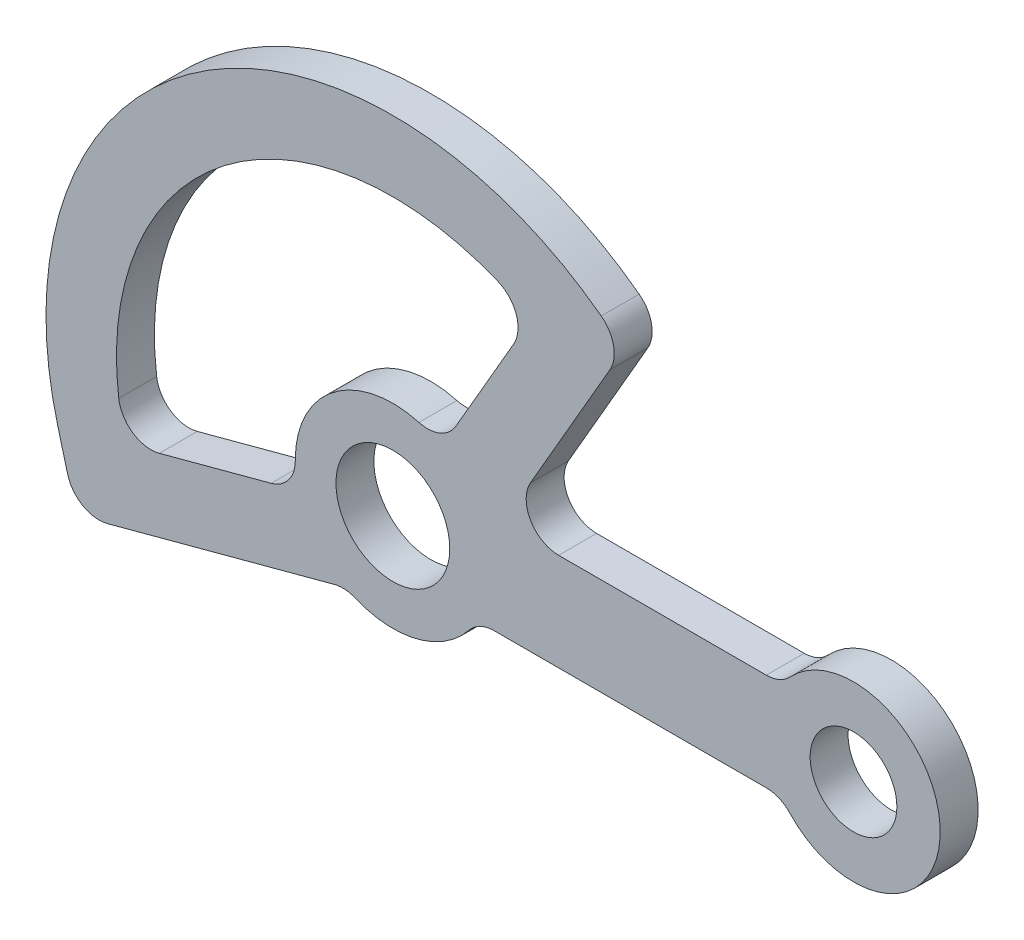
ISO-10303-21;
HEADER;
FILE_DESCRIPTION(('STEP AP214'),'2;1');
FILE_NAME('part.step','',(''),(''),'','','');
FILE_SCHEMA(('AUTOMOTIVE_DESIGN { 1 0 10303 214 1 1 1 1 }'));
ENDSEC;
DATA;
#1=APPLICATION_CONTEXT('core data for automotive mechanical design processes');
#2=APPLICATION_PROTOCOL_DEFINITION('international standard','automotive_design',2000,#1);
#3=PRODUCT_CONTEXT('',#1,'mechanical');
#4=PRODUCT('Part','Part','',(#3));
#5=PRODUCT_RELATED_PRODUCT_CATEGORY('part','',(#4));
#6=PRODUCT_DEFINITION_FORMATION('','',#4);
#7=PRODUCT_DEFINITION_CONTEXT('part definition',#1,'design');
#8=PRODUCT_DEFINITION('design','',#6,#7);
#9=PRODUCT_DEFINITION_SHAPE('','',#8);
#10=(LENGTH_UNIT() NAMED_UNIT(*) SI_UNIT(.MILLI.,.METRE.));
#11=(NAMED_UNIT(*) PLANE_ANGLE_UNIT() SI_UNIT($,.RADIAN.));
#12=(NAMED_UNIT(*) SI_UNIT($,.STERADIAN.) SOLID_ANGLE_UNIT());
#13=UNCERTAINTY_MEASURE_WITH_UNIT(LENGTH_MEASURE(1.E-05),#10,'distance_accuracy_value','');
#14=(GEOMETRIC_REPRESENTATION_CONTEXT(3) GLOBAL_UNCERTAINTY_ASSIGNED_CONTEXT((#13)) GLOBAL_UNIT_ASSIGNED_CONTEXT((#10,
#11,#12)) REPRESENTATION_CONTEXT('',''));
#15=CARTESIAN_POINT('',(0.,0.,0.));
#16=DIRECTION('',(0.,0.,1.));
#17=DIRECTION('',(1.,0.,0.));
#18=AXIS2_PLACEMENT_3D('',#15,#16,#17);
#19=CARTESIAN_POINT('',(68.9065230605689,15.,7.));
#20=DIRECTION('',(0.,0.,1.));
#21=DIRECTION('',(1.,0.,0.));
#22=AXIS2_PLACEMENT_3D('',#19,#20,#21);
#23=PLANE('',#22);
#24=CARTESIAN_POINT('',(0.,0.,7.));
#25=DIRECTION('',(0.,0.,1.));
#26=DIRECTION('',(1.,0.,0.));
#27=AXIS2_PLACEMENT_3D('',#24,#25,#26);
#28=CIRCLE('',#27,10.5);
#29=CARTESIAN_POINT('',(10.5,0.,7.));
#30=VERTEX_POINT('',#29);
#31=EDGE_CURVE('E267',#30,#30,#28,.T.);
#32=ORIENTED_EDGE('',*,*,#31,.F.);
#33=EDGE_LOOP('',(#32));
#34=FACE_BOUND('',#33,.T.);
#35=CARTESIAN_POINT('',(68.9065230605689,15.,7.));
#36=DIRECTION('',(0.,0.,-1.));
#37=DIRECTION('',(1.,0.,0.));
#38=AXIS2_PLACEMENT_3D('',#35,#36,#37);
#39=CIRCLE('',#38,6.);
#40=CARTESIAN_POINT('',(73.2956531349592,10.9090909090909,7.));
#41=VERTEX_POINT('',#40);
#42=CARTESIAN_POINT('',(68.9065230605689,9.,7.));
#43=VERTEX_POINT('',#42);
#44=EDGE_CURVE('E273',#41,#43,#39,.T.);
#45=ORIENTED_EDGE('',*,*,#44,.T.);
#46=DIRECTION('',(-1.,0.,0.));
#47=VECTOR('',#46,1.);
#48=CARTESIAN_POINT('',(68.9065230605689,9.,7.));
#49=LINE('',#48,#47);
#50=CARTESIAN_POINT('',(30.59956426705,8.99999999999999,7.));
#51=VERTEX_POINT('',#50);
#52=EDGE_CURVE('E276',#43,#51,#49,.T.);
#53=ORIENTED_EDGE('',*,*,#52,.T.);
#54=CARTESIAN_POINT('',(30.59956426705,15.,7.));
#55=DIRECTION('',(0.,0.,-1.));
#56=DIRECTION('',(-1.,0.,0.));
#57=AXIS2_PLACEMENT_3D('',#54,#55,#56);
#58=CIRCLE('',#57,5.99999999999999);
#59=CARTESIAN_POINT('',(25.4034118443433,18.,7.));
#60=VERTEX_POINT('',#59);
#61=EDGE_CURVE('E279',#51,#60,#58,.T.);
#62=ORIENTED_EDGE('',*,*,#61,.T.);
#63=DIRECTION('',(0.499999999999994,0.866025403784442,0.));
#64=VECTOR('',#63,1.);
#65=CARTESIAN_POINT('',(25.4034118443433,18.,7.));
#66=LINE('',#65,#64);
#67=CARTESIAN_POINT('',(40.046348590167,43.3623104157842,7.));
#68=VERTEX_POINT('',#67);
#69=EDGE_CURVE('E281',#60,#68,#66,.T.);
#70=ORIENTED_EDGE('',*,*,#69,.T.);
#71=CARTESIAN_POINT('',(34.8501961674603,46.3623104157842,7.));
#72=DIRECTION('',(0.,0.,1.));
#73=DIRECTION('',(-1.,0.,0.));
#74=AXIS2_PLACEMENT_3D('',#71,#72,#73);
#75=CIRCLE('',#74,6.);
#76=CARTESIAN_POINT('',(38.455388874439,51.1584114932791,7.));
#77=VERTEX_POINT('',#76);
#78=EDGE_CURVE('E283',#68,#77,#75,.T.);
#79=ORIENTED_EDGE('',*,*,#78,.T.);
#80=CARTESIAN_POINT('',(0.,0.,7.));
#81=DIRECTION('',(0.,0.,1.));
#82=DIRECTION('',(1.,0.,0.));
#83=AXIS2_PLACEMENT_3D('',#80,#81,#82);
#84=CIRCLE('',#83,64.);
#85=CARTESIAN_POINT('',(-61.8192528824995,-16.5644188865645,7.));
#86=VERTEX_POINT('',#85);
#87=EDGE_CURVE('E285',#77,#86,#84,.T.);
#88=ORIENTED_EDGE('',*,*,#87,.T.);
#89=DIRECTION('',(0.258819045102569,-0.965925826289055,0.));
#90=VECTOR('',#89,1.);
#91=CARTESIAN_POINT('',(-61.8192528824995,-16.5644188865645,7.));
#92=LINE('',#91,#90);
#93=CARTESIAN_POINT('',(-60.0075195667823,-23.325899670585,7.));
#94=VERTEX_POINT('',#93);
#95=EDGE_CURVE('E287',#86,#94,#92,.T.);
#96=ORIENTED_EDGE('',*,*,#95,.T.);
#97=CARTESIAN_POINT('',(-54.211964609048,-21.7729853999696,7.));
#98=DIRECTION('',(0.,0.,1.));
#99=DIRECTION('',(1.,0.,0.));
#100=AXIS2_PLACEMENT_3D('',#97,#98,#99);
#101=CIRCLE('',#100,6.);
#102=CARTESIAN_POINT('',(-52.6590503384328,-27.568540357704,7.));
#103=VERTEX_POINT('',#102);
#104=EDGE_CURVE('E289',#94,#103,#101,.T.);
#105=ORIENTED_EDGE('',*,*,#104,.T.);
#106=DIRECTION('',(0.965925826289068,0.258819045102522,0.));
#107=VECTOR('',#106,1.);
#108=CARTESIAN_POINT('',(-10.7986052500331,-16.35206790146,7.));
#109=LINE('',#108,#107);
#110=CARTESIAN_POINT('',(-10.7986052500331,-16.35206790146,7.));
#111=VERTEX_POINT('',#110);
#112=EDGE_CURVE('E291',#103,#111,#109,.T.);
#113=ORIENTED_EDGE('',*,*,#112,.T.);
#114=CARTESIAN_POINT('',(-9.245690979418,-22.1476228591944,7.));
#115=DIRECTION('',(0.,0.,-1.));
#116=DIRECTION('',(-1.,0.,0.));
#117=AXIS2_PLACEMENT_3D('',#114,#115,#116);
#118=CIRCLE('',#117,6.);
#119=CARTESIAN_POINT('',(-6.9342682345635,-16.6107171443958,7.));
#120=VERTEX_POINT('',#119);
#121=EDGE_CURVE('E293',#111,#120,#118,.T.);
#122=ORIENTED_EDGE('',*,*,#121,.T.);
#123=CARTESIAN_POINT('',(0.,0.,7.));
#124=DIRECTION('',(0.,0.,1.));
#125=DIRECTION('',(1.,0.,0.));
#126=AXIS2_PLACEMENT_3D('',#123,#124,#125);
#127=CIRCLE('',#126,18.);
#128=CARTESIAN_POINT('',(14.0512454963964,-11.25,7.));
#129=VERTEX_POINT('',#128);
#130=EDGE_CURVE('E295',#120,#129,#127,.T.);
#131=ORIENTED_EDGE('',*,*,#130,.T.);
#132=CARTESIAN_POINT('',(18.7349939951952,-15.,7.));
#133=DIRECTION('',(0.,0.,-1.));
#134=DIRECTION('',(1.,0.,0.));
#135=AXIS2_PLACEMENT_3D('',#132,#133,#134);
#136=CIRCLE('',#135,6.);
#137=CARTESIAN_POINT('',(18.7349939951952,-9.00000000000001,7.));
#138=VERTEX_POINT('',#137);
#139=EDGE_CURVE('E297',#129,#138,#136,.T.);
#140=ORIENTED_EDGE('',*,*,#139,.T.);
#141=DIRECTION('',(1.,0.,0.));
#142=VECTOR('',#141,1.);
#143=CARTESIAN_POINT('',(68.9065230605689,-9.,7.));
#144=LINE('',#143,#142);
#145=CARTESIAN_POINT('',(68.9065230605689,-9.,7.));
#146=VERTEX_POINT('',#145);
#147=EDGE_CURVE('E299',#138,#146,#144,.T.);
#148=ORIENTED_EDGE('',*,*,#147,.T.);
#149=CARTESIAN_POINT('',(68.9065230605689,-15.,7.));
#150=DIRECTION('',(0.,0.,-1.));
#151=DIRECTION('',(-1.,0.,0.));
#152=AXIS2_PLACEMENT_3D('',#149,#150,#151);
#153=CIRCLE('',#152,6.);
#154=CARTESIAN_POINT('',(73.2956531349592,-10.9090909090909,7.));
#155=VERTEX_POINT('',#154);
#156=EDGE_CURVE('E301',#146,#155,#153,.T.);
#157=ORIENTED_EDGE('',*,*,#156,.T.);
#158=CARTESIAN_POINT('',(85.,0.,7.));
#159=DIRECTION('',(0.,0.,1.));
#160=DIRECTION('',(1.,0.,0.));
#161=AXIS2_PLACEMENT_3D('',#158,#159,#160);
#162=CIRCLE('',#161,16.);
#163=EDGE_CURVE('E303',#155,#41,#162,.T.);
#164=ORIENTED_EDGE('',*,*,#163,.T.);
#165=EDGE_LOOP('',(#45,#53,#62,#70,#79,#88,#96,#105,#113,#122,#131,#140,#148,#157,#164));
#166=FACE_BOUND('',#165,.T.);
#167=CARTESIAN_POINT('',(85.,0.,7.));
#168=DIRECTION('',(0.,0.,1.));
#169=DIRECTION('',(1.,0.,0.));
#170=AXIS2_PLACEMENT_3D('',#167,#168,#169);
#171=CIRCLE('',#170,8.00000000000001);
#172=CARTESIAN_POINT('',(93.,0.,7.));
#173=VERTEX_POINT('',#172);
#174=EDGE_CURVE('E261',#173,#173,#171,.T.);
#175=ORIENTED_EDGE('',*,*,#174,.F.);
#176=EDGE_LOOP('',(#175));
#177=FACE_BOUND('',#176,.T.);
#178=DIRECTION('',(0.499999999999994,0.866025403784442,0.));
#179=VECTOR('',#178,1.);
#180=CARTESIAN_POINT('',(22.2991031209775,38.6231795687513,7.));
#181=LINE('',#180,#179);
#182=CARTESIAN_POINT('',(11.6189500386221,20.1246117974982,7.));
#183=VERTEX_POINT('',#182);
#184=CARTESIAN_POINT('',(22.2991031209775,38.6231795687513,7.));
#185=VERTEX_POINT('',#184);
#186=EDGE_CURVE('E204',#183,#185,#181,.T.);
#187=ORIENTED_EDGE('',*,*,#186,.F.);
#188=CARTESIAN_POINT('',(6.42279761591545,23.1246117974982,7.));
#189=DIRECTION('',(0.,0.,1.));
#190=DIRECTION('',(1.,0.,0.));
#191=AXIS2_PLACEMENT_3D('',#188,#189,#190);
#192=CIRCLE('',#191,6.00000000000001);
#193=CARTESIAN_POINT('',(4.8170982119366,17.3434588481236,7.));
#194=VERTEX_POINT('',#193);
#195=EDGE_CURVE('E196',#194,#183,#192,.T.);
#196=ORIENTED_EDGE('',*,*,#195,.F.);
#197=CARTESIAN_POINT('',(0.,0.,7.));
#198=DIRECTION('',(0.,0.,-1.));
#199=DIRECTION('',(1.,0.,0.));
#200=AXIS2_PLACEMENT_3D('',#197,#198,#199);
#201=CIRCLE('',#200,18.);
#202=CARTESIAN_POINT('',(-17.9992515779627,-0.164142112834368,7.));
#203=VERTEX_POINT('',#202);
#204=EDGE_CURVE('E229',#203,#194,#201,.T.);
#205=ORIENTED_EDGE('',*,*,#204,.F.);
#206=CARTESIAN_POINT('',(-23.9990021039503,-0.21885615044583,7.));
#207=DIRECTION('',(0.,0.,1.));
#208=DIRECTION('',(1.,0.,0.));
#209=AXIS2_PLACEMENT_3D('',#206,#207,#208);
#210=CIRCLE('',#209,6.);
#211=CARTESIAN_POINT('',(-22.4460878333352,-6.01441110818024,7.));
#212=VERTEX_POINT('',#211);
#213=EDGE_CURVE('E227',#212,#203,#210,.T.);
#214=ORIENTED_EDGE('',*,*,#213,.F.);
#215=DIRECTION('',(0.965925826289068,0.258819045102522,0.));
#216=VECTOR('',#215,1.);
#217=CARTESIAN_POINT('',(-22.4460878333352,-6.01441110818024,7.));
#218=LINE('',#217,#216);
#219=CARTESIAN_POINT('',(-43.0785592152711,-11.5428651528282,7.));
#220=VERTEX_POINT('',#219);
#221=EDGE_CURVE('E225',#220,#212,#218,.T.);
#222=ORIENTED_EDGE('',*,*,#221,.F.);
#223=CARTESIAN_POINT('',(-44.6314734858863,-5.74731019509384,7.));
#224=DIRECTION('',(0.,0.,1.));
#225=DIRECTION('',(1.,0.,0.));
#226=AXIS2_PLACEMENT_3D('',#223,#224,#225);
#227=CIRCLE('',#226,6.);
#228=CARTESIAN_POINT('',(-50.5823366173378,-6.51361822110635,7.));
#229=VERTEX_POINT('',#228);
#230=EDGE_CURVE('E223',#229,#220,#227,.T.);
#231=ORIENTED_EDGE('',*,*,#230,.F.);
#232=CARTESIAN_POINT('',(0.,0.,7.));
#233=DIRECTION('',(0.,0.,1.));
#234=DIRECTION('',(1.,0.,0.));
#235=AXIS2_PLACEMENT_3D('',#232,#233,#234);
#236=CIRCLE('',#235,51.);
#237=CARTESIAN_POINT('',(19.383344124707,47.1729368445848,7.));
#238=VERTEX_POINT('',#237);
#239=EDGE_CURVE('E219',#238,#229,#236,.T.);
#240=ORIENTED_EDGE('',*,*,#239,.F.);
#241=CARTESIAN_POINT('',(17.1029506982708,41.6231795687513,7.));
#242=DIRECTION('',(0.,0.,1.));
#243=DIRECTION('',(-1.,0.,0.));
#244=AXIS2_PLACEMENT_3D('',#241,#242,#243);
#245=CIRCLE('',#244,6.00000000000001);
#246=EDGE_CURVE('E217',#185,#238,#245,.T.);
#247=ORIENTED_EDGE('',*,*,#246,.F.);
#248=EDGE_LOOP('',(#187,#196,#205,#214,#222,#231,#240,#247));
#249=FACE_BOUND('',#248,.T.);
#250=ADVANCED_FACE('F41',(#34,#166,#177,#249),#23,.T.);
#251=CARTESIAN_POINT('',(68.9065230605689,15.,0.));
#252=DIRECTION('',(0.,0.,1.));
#253=DIRECTION('',(1.,0.,0.));
#254=AXIS2_PLACEMENT_3D('',#251,#252,#253);
#255=PLANE('',#254);
#256=CARTESIAN_POINT('',(85.,0.,0.));
#257=DIRECTION('',(0.,0.,1.));
#258=DIRECTION('',(1.,0.,0.));
#259=AXIS2_PLACEMENT_3D('',#256,#257,#258);
#260=CIRCLE('',#259,8.00000000000001);
#261=CARTESIAN_POINT('',(93.,0.,0.));
#262=VERTEX_POINT('',#261);
#263=EDGE_CURVE('E212',#262,#262,#260,.T.);
#264=ORIENTED_EDGE('',*,*,#263,.T.);
#265=EDGE_LOOP('',(#264));
#266=FACE_BOUND('',#265,.T.);
#267=CARTESIAN_POINT('',(0.,0.,0.));
#268=DIRECTION('',(0.,0.,1.));
#269=DIRECTION('',(1.,0.,0.));
#270=AXIS2_PLACEMENT_3D('',#267,#268,#269);
#271=CIRCLE('',#270,10.5);
#272=CARTESIAN_POINT('',(10.5,0.,0.));
#273=VERTEX_POINT('',#272);
#274=EDGE_CURVE('E264',#273,#273,#271,.T.);
#275=ORIENTED_EDGE('',*,*,#274,.T.);
#276=EDGE_LOOP('',(#275));
#277=FACE_BOUND('',#276,.T.);
#278=CARTESIAN_POINT('',(68.9065230605689,15.,0.));
#279=DIRECTION('',(0.,0.,-1.));
#280=DIRECTION('',(1.,0.,0.));
#281=AXIS2_PLACEMENT_3D('',#278,#279,#280);
#282=CIRCLE('',#281,6.);
#283=CARTESIAN_POINT('',(73.2956531349592,10.9090909090909,0.));
#284=VERTEX_POINT('',#283);
#285=CARTESIAN_POINT('',(68.9065230605689,9.,0.));
#286=VERTEX_POINT('',#285);
#287=EDGE_CURVE('E270',#284,#286,#282,.T.);
#288=ORIENTED_EDGE('',*,*,#287,.F.);
#289=CARTESIAN_POINT('',(85.,0.,0.));
#290=DIRECTION('',(0.,0.,1.));
#291=DIRECTION('',(1.,0.,0.));
#292=AXIS2_PLACEMENT_3D('',#289,#290,#291);
#293=CIRCLE('',#292,16.);
#294=CARTESIAN_POINT('',(73.2956531349592,-10.9090909090909,0.));
#295=VERTEX_POINT('',#294);
#296=EDGE_CURVE('E277',#295,#284,#293,.T.);
#297=ORIENTED_EDGE('',*,*,#296,.F.);
#298=CARTESIAN_POINT('',(68.9065230605689,-15.,0.));
#299=DIRECTION('',(0.,0.,-1.));
#300=DIRECTION('',(-1.,0.,0.));
#301=AXIS2_PLACEMENT_3D('',#298,#299,#300);
#302=CIRCLE('',#301,6.);
#303=CARTESIAN_POINT('',(68.9065230605689,-9.,0.));
#304=VERTEX_POINT('',#303);
#305=EDGE_CURVE('E332',#304,#295,#302,.T.);
#306=ORIENTED_EDGE('',*,*,#305,.F.);
#307=DIRECTION('',(1.,0.,0.));
#308=VECTOR('',#307,1.);
#309=CARTESIAN_POINT('',(68.9065230605689,-9.,0.));
#310=LINE('',#309,#308);
#311=CARTESIAN_POINT('',(18.7349939951952,-9.00000000000001,0.));
#312=VERTEX_POINT('',#311);
#313=EDGE_CURVE('E330',#312,#304,#310,.T.);
#314=ORIENTED_EDGE('',*,*,#313,.F.);
#315=CARTESIAN_POINT('',(18.7349939951952,-15.,0.));
#316=DIRECTION('',(0.,0.,-1.));
#317=DIRECTION('',(1.,0.,0.));
#318=AXIS2_PLACEMENT_3D('',#315,#316,#317);
#319=CIRCLE('',#318,6.);
#320=CARTESIAN_POINT('',(14.0512454963964,-11.25,0.));
#321=VERTEX_POINT('',#320);
#322=EDGE_CURVE('E328',#321,#312,#319,.T.);
#323=ORIENTED_EDGE('',*,*,#322,.F.);
#324=CARTESIAN_POINT('',(0.,0.,0.));
#325=DIRECTION('',(0.,0.,1.));
#326=DIRECTION('',(1.,0.,0.));
#327=AXIS2_PLACEMENT_3D('',#324,#325,#326);
#328=CIRCLE('',#327,18.);
#329=CARTESIAN_POINT('',(-6.9342682345635,-16.6107171443958,0.));
#330=VERTEX_POINT('',#329);
#331=EDGE_CURVE('E326',#330,#321,#328,.T.);
#332=ORIENTED_EDGE('',*,*,#331,.F.);
#333=CARTESIAN_POINT('',(-9.245690979418,-22.1476228591944,0.));
#334=DIRECTION('',(0.,0.,-1.));
#335=DIRECTION('',(-1.,0.,0.));
#336=AXIS2_PLACEMENT_3D('',#333,#334,#335);
#337=CIRCLE('',#336,6.);
#338=CARTESIAN_POINT('',(-10.7986052500331,-16.35206790146,0.));
#339=VERTEX_POINT('',#338);
#340=EDGE_CURVE('E324',#339,#330,#337,.T.);
#341=ORIENTED_EDGE('',*,*,#340,.F.);
#342=DIRECTION('',(0.965925826289068,0.258819045102522,0.));
#343=VECTOR('',#342,1.);
#344=CARTESIAN_POINT('',(-10.7986052500331,-16.35206790146,0.));
#345=LINE('',#344,#343);
#346=CARTESIAN_POINT('',(-52.6590503384328,-27.568540357704,0.));
#347=VERTEX_POINT('',#346);
#348=EDGE_CURVE('E322',#347,#339,#345,.T.);
#349=ORIENTED_EDGE('',*,*,#348,.F.);
#350=CARTESIAN_POINT('',(-54.211964609048,-21.7729853999696,0.));
#351=DIRECTION('',(0.,0.,1.));
#352=DIRECTION('',(1.,0.,0.));
#353=AXIS2_PLACEMENT_3D('',#350,#351,#352);
#354=CIRCLE('',#353,6.);
#355=CARTESIAN_POINT('',(-60.0075195667823,-23.325899670585,0.));
#356=VERTEX_POINT('',#355);
#357=EDGE_CURVE('E320',#356,#347,#354,.T.);
#358=ORIENTED_EDGE('',*,*,#357,.F.);
#359=DIRECTION('',(0.258819045102569,-0.965925826289055,0.));
#360=VECTOR('',#359,1.);
#361=CARTESIAN_POINT('',(-61.8192528824995,-16.5644188865645,0.));
#362=LINE('',#361,#360);
#363=CARTESIAN_POINT('',(-61.8192528824995,-16.5644188865645,0.));
#364=VERTEX_POINT('',#363);
#365=EDGE_CURVE('E318',#364,#356,#362,.T.);
#366=ORIENTED_EDGE('',*,*,#365,.F.);
#367=CARTESIAN_POINT('',(0.,0.,0.));
#368=DIRECTION('',(0.,0.,1.));
#369=DIRECTION('',(1.,0.,0.));
#370=AXIS2_PLACEMENT_3D('',#367,#368,#369);
#371=CIRCLE('',#370,64.);
#372=CARTESIAN_POINT('',(38.455388874439,51.1584114932791,0.));
#373=VERTEX_POINT('',#372);
#374=EDGE_CURVE('E316',#373,#364,#371,.T.);
#375=ORIENTED_EDGE('',*,*,#374,.F.);
#376=CARTESIAN_POINT('',(34.8501961674603,46.3623104157842,0.));
#377=DIRECTION('',(0.,0.,1.));
#378=DIRECTION('',(-1.,0.,0.));
#379=AXIS2_PLACEMENT_3D('',#376,#377,#378);
#380=CIRCLE('',#379,6.);
#381=CARTESIAN_POINT('',(40.046348590167,43.3623104157842,0.));
#382=VERTEX_POINT('',#381);
#383=EDGE_CURVE('E314',#382,#373,#380,.T.);
#384=ORIENTED_EDGE('',*,*,#383,.F.);
#385=DIRECTION('',(0.499999999999994,0.866025403784442,0.));
#386=VECTOR('',#385,1.);
#387=CARTESIAN_POINT('',(25.4034118443433,18.,0.));
#388=LINE('',#387,#386);
#389=CARTESIAN_POINT('',(25.4034118443433,18.,0.));
#390=VERTEX_POINT('',#389);
#391=EDGE_CURVE('E312',#390,#382,#388,.T.);
#392=ORIENTED_EDGE('',*,*,#391,.F.);
#393=CARTESIAN_POINT('',(30.59956426705,15.,0.));
#394=DIRECTION('',(0.,0.,-1.));
#395=DIRECTION('',(-1.,0.,0.));
#396=AXIS2_PLACEMENT_3D('',#393,#394,#395);
#397=CIRCLE('',#396,5.99999999999999);
#398=CARTESIAN_POINT('',(30.59956426705,8.99999999999999,0.));
#399=VERTEX_POINT('',#398);
#400=EDGE_CURVE('E310',#399,#390,#397,.T.);
#401=ORIENTED_EDGE('',*,*,#400,.F.);
#402=DIRECTION('',(-1.,0.,0.));
#403=VECTOR('',#402,1.);
#404=CARTESIAN_POINT('',(68.9065230605689,9.,0.));
#405=LINE('',#404,#403);
#406=EDGE_CURVE('E308',#286,#399,#405,.T.);
#407=ORIENTED_EDGE('',*,*,#406,.F.);
#408=EDGE_LOOP('',(#288,#297,#306,#314,#323,#332,#341,#349,#358,#366,#375,#384,#392,#401,#407));
#409=FACE_BOUND('',#408,.T.);
#410=CARTESIAN_POINT('',(6.42279761591545,23.1246117974982,0.));
#411=DIRECTION('',(0.,0.,1.));
#412=DIRECTION('',(1.,0.,0.));
#413=AXIS2_PLACEMENT_3D('',#410,#411,#412);
#414=CIRCLE('',#413,6.00000000000001);
#415=CARTESIAN_POINT('',(4.8170982119366,17.3434588481236,0.));
#416=VERTEX_POINT('',#415);
#417=CARTESIAN_POINT('',(11.6189500386221,20.1246117974982,0.));
#418=VERTEX_POINT('',#417);
#419=EDGE_CURVE('E64',#416,#418,#414,.T.);
#420=ORIENTED_EDGE('',*,*,#419,.T.);
#421=DIRECTION('',(0.499999999999994,0.866025403784442,0.));
#422=VECTOR('',#421,1.);
#423=CARTESIAN_POINT('',(22.2991031209775,38.6231795687513,0.));
#424=LINE('',#423,#422);
#425=CARTESIAN_POINT('',(22.2991031209775,38.6231795687513,0.));
#426=VERTEX_POINT('',#425);
#427=EDGE_CURVE('E211',#418,#426,#424,.T.);
#428=ORIENTED_EDGE('',*,*,#427,.T.);
#429=CARTESIAN_POINT('',(17.1029506982708,41.6231795687513,0.));
#430=DIRECTION('',(0.,0.,1.));
#431=DIRECTION('',(-1.,0.,0.));
#432=AXIS2_PLACEMENT_3D('',#429,#430,#431);
#433=CIRCLE('',#432,6.00000000000001);
#434=CARTESIAN_POINT('',(19.383344124707,47.1729368445848,0.));
#435=VERTEX_POINT('',#434);
#436=EDGE_CURVE('E233',#426,#435,#433,.T.);
#437=ORIENTED_EDGE('',*,*,#436,.T.);
#438=CARTESIAN_POINT('',(0.,0.,0.));
#439=DIRECTION('',(0.,0.,1.));
#440=DIRECTION('',(1.,0.,0.));
#441=AXIS2_PLACEMENT_3D('',#438,#439,#440);
#442=CIRCLE('',#441,51.);
#443=CARTESIAN_POINT('',(-50.5823366173378,-6.51361822110635,0.));
#444=VERTEX_POINT('',#443);
#445=EDGE_CURVE('E236',#435,#444,#442,.T.);
#446=ORIENTED_EDGE('',*,*,#445,.T.);
#447=CARTESIAN_POINT('',(-44.6314734858863,-5.74731019509384,0.));
#448=DIRECTION('',(0.,0.,1.));
#449=DIRECTION('',(1.,0.,0.));
#450=AXIS2_PLACEMENT_3D('',#447,#448,#449);
#451=CIRCLE('',#450,6.);
#452=CARTESIAN_POINT('',(-43.0785592152711,-11.5428651528282,0.));
#453=VERTEX_POINT('',#452);
#454=EDGE_CURVE('E239',#444,#453,#451,.T.);
#455=ORIENTED_EDGE('',*,*,#454,.T.);
#456=DIRECTION('',(0.965925826289068,0.258819045102522,0.));
#457=VECTOR('',#456,1.);
#458=CARTESIAN_POINT('',(-22.4460878333352,-6.01441110818024,0.));
#459=LINE('',#458,#457);
#460=CARTESIAN_POINT('',(-22.4460878333352,-6.01441110818024,0.));
#461=VERTEX_POINT('',#460);
#462=EDGE_CURVE('E242',#453,#461,#459,.T.);
#463=ORIENTED_EDGE('',*,*,#462,.T.);
#464=CARTESIAN_POINT('',(-23.9990021039503,-0.21885615044583,0.));
#465=DIRECTION('',(0.,0.,1.));
#466=DIRECTION('',(1.,0.,0.));
#467=AXIS2_PLACEMENT_3D('',#464,#465,#466);
#468=CIRCLE('',#467,6.);
#469=CARTESIAN_POINT('',(-17.9992515779627,-0.164142112834368,0.));
#470=VERTEX_POINT('',#469);
#471=EDGE_CURVE('E245',#461,#470,#468,.T.);
#472=ORIENTED_EDGE('',*,*,#471,.T.);
#473=CARTESIAN_POINT('',(0.,0.,0.));
#474=DIRECTION('',(0.,0.,-1.));
#475=DIRECTION('',(1.,0.,0.));
#476=AXIS2_PLACEMENT_3D('',#473,#474,#475);
#477=CIRCLE('',#476,18.);
#478=EDGE_CURVE('E205',#470,#416,#477,.T.);
#479=ORIENTED_EDGE('',*,*,#478,.T.);
#480=EDGE_LOOP('',(#420,#428,#437,#446,#455,#463,#472,#479));
#481=FACE_BOUND('',#480,.T.);
#482=ADVANCED_FACE('F383',(#266,#277,#409,#481),#255,.F.);
#483=CARTESIAN_POINT('',(68.9065230605689,15.,7.));
#484=DIRECTION('',(0.,0.,-1.));
#485=DIRECTION('',(-1.,0.,0.));
#486=AXIS2_PLACEMENT_3D('',#483,#484,#485);
#487=CYLINDRICAL_SURFACE('',#486,6.);
#488=ORIENTED_EDGE('',*,*,#287,.T.);
#489=DIRECTION('',(0.,0.,-1.));
#490=VECTOR('',#489,1.);
#491=CARTESIAN_POINT('',(68.9065230605689,9.,7.));
#492=LINE('',#491,#490);
#493=EDGE_CURVE('E11',#43,#286,#492,.T.);
#494=ORIENTED_EDGE('',*,*,#493,.F.);
#495=ORIENTED_EDGE('',*,*,#44,.F.);
#496=DIRECTION('',(0.,0.,-1.));
#497=VECTOR('',#496,1.);
#498=CARTESIAN_POINT('',(73.2956531349592,10.9090909090909,7.));
#499=LINE('',#498,#497);
#500=EDGE_CURVE('E305',#41,#284,#499,.T.);
#501=ORIENTED_EDGE('',*,*,#500,.T.);
#502=EDGE_LOOP('',(#488,#494,#495,#501));
#503=FACE_BOUND('',#502,.T.);
#504=ADVANCED_FACE('F43',(#503),#487,.F.);
#505=CARTESIAN_POINT('',(68.9065230605689,9.,7.));
#506=DIRECTION('',(0.,-1.,0.));
#507=DIRECTION('',(1.,0.,0.));
#508=AXIS2_PLACEMENT_3D('',#505,#506,#507);
#509=PLANE('',#508);
#510=ORIENTED_EDGE('',*,*,#406,.T.);
#511=DIRECTION('',(0.,0.,-1.));
#512=VECTOR('',#511,1.);
#513=CARTESIAN_POINT('',(30.59956426705,8.99999999999999,7.));
#514=LINE('',#513,#512);
#515=EDGE_CURVE('E49',#51,#399,#514,.T.);
#516=ORIENTED_EDGE('',*,*,#515,.F.);
#517=ORIENTED_EDGE('',*,*,#52,.F.);
#518=ORIENTED_EDGE('',*,*,#493,.T.);
#519=EDGE_LOOP('',(#510,#516,#517,#518));
#520=FACE_BOUND('',#519,.T.);
#521=ADVANCED_FACE('F401',(#520),#509,.F.);
#522=CARTESIAN_POINT('',(30.59956426705,15.,7.));
#523=DIRECTION('',(0.,0.,-1.));
#524=DIRECTION('',(-1.,0.,0.));
#525=AXIS2_PLACEMENT_3D('',#522,#523,#524);
#526=CYLINDRICAL_SURFACE('',#525,5.99999999999999);
#527=ORIENTED_EDGE('',*,*,#400,.T.);
#528=DIRECTION('',(0.,0.,-1.));
#529=VECTOR('',#528,1.);
#530=CARTESIAN_POINT('',(25.4034118443433,18.,7.));
#531=LINE('',#530,#529);
#532=EDGE_CURVE('E370',#60,#390,#531,.T.);
#533=ORIENTED_EDGE('',*,*,#532,.F.);
#534=ORIENTED_EDGE('',*,*,#61,.F.);
#535=ORIENTED_EDGE('',*,*,#515,.T.);
#536=EDGE_LOOP('',(#527,#533,#534,#535));
#537=FACE_BOUND('',#536,.T.);
#538=ADVANCED_FACE('F377',(#537),#526,.F.);
#539=CARTESIAN_POINT('',(25.4034118443433,18.,7.));
#540=DIRECTION('',(-0.866025403784442,0.499999999999994,0.));
#541=DIRECTION('',(-0.499999999999994,-0.866025403784442,0.));
#542=AXIS2_PLACEMENT_3D('',#539,#540,#541);
#543=PLANE('',#542);
#544=ORIENTED_EDGE('',*,*,#391,.T.);
#545=DIRECTION('',(0.,0.,-1.));
#546=VECTOR('',#545,1.);
#547=CARTESIAN_POINT('',(40.046348590167,43.3623104157842,7.));
#548=LINE('',#547,#546);
#549=EDGE_CURVE('E367',#68,#382,#548,.T.);
#550=ORIENTED_EDGE('',*,*,#549,.F.);
#551=ORIENTED_EDGE('',*,*,#69,.F.);
#552=ORIENTED_EDGE('',*,*,#532,.T.);
#553=EDGE_LOOP('',(#544,#550,#551,#552));
#554=FACE_BOUND('',#553,.T.);
#555=ADVANCED_FACE('F389',(#554),#543,.F.);
#556=CARTESIAN_POINT('',(34.8501961674603,46.3623104157842,7.));
#557=DIRECTION('',(0.,0.,-1.));
#558=DIRECTION('',(-1.,0.,0.));
#559=AXIS2_PLACEMENT_3D('',#556,#557,#558);
#560=CYLINDRICAL_SURFACE('',#559,6.);
#561=ORIENTED_EDGE('',*,*,#383,.T.);
#562=DIRECTION('',(0.,0.,-1.));
#563=VECTOR('',#562,1.);
#564=CARTESIAN_POINT('',(38.455388874439,51.1584114932791,7.));
#565=LINE('',#564,#563);
#566=EDGE_CURVE('E364',#77,#373,#565,.T.);
#567=ORIENTED_EDGE('',*,*,#566,.F.);
#568=ORIENTED_EDGE('',*,*,#78,.F.);
#569=ORIENTED_EDGE('',*,*,#549,.T.);
#570=EDGE_LOOP('',(#561,#567,#568,#569));
#571=FACE_BOUND('',#570,.T.);
#572=ADVANCED_FACE('F393',(#571),#560,.T.);
#573=CARTESIAN_POINT('',(0.,0.,7.));
#574=DIRECTION('',(0.,0.,-1.));
#575=DIRECTION('',(-1.,0.,0.));
#576=AXIS2_PLACEMENT_3D('',#573,#574,#575);
#577=CYLINDRICAL_SURFACE('',#576,64.);
#578=ORIENTED_EDGE('',*,*,#374,.T.);
#579=DIRECTION('',(0.,0.,-1.));
#580=VECTOR('',#579,1.);
#581=CARTESIAN_POINT('',(-61.8192528824995,-16.5644188865645,7.));
#582=LINE('',#581,#580);
#583=EDGE_CURVE('E361',#86,#364,#582,.T.);
#584=ORIENTED_EDGE('',*,*,#583,.F.);
#585=ORIENTED_EDGE('',*,*,#87,.F.);
#586=ORIENTED_EDGE('',*,*,#566,.T.);
#587=EDGE_LOOP('',(#578,#584,#585,#586));
#588=FACE_BOUND('',#587,.T.);
#589=ADVANCED_FACE('F449',(#588),#577,.T.);
#590=CARTESIAN_POINT('',(-61.8192528824995,-16.5644188865645,7.));
#591=DIRECTION('',(0.965925826289055,0.258819045102569,0.));
#592=DIRECTION('',(-0.258819045102569,0.965925826289055,0.));
#593=AXIS2_PLACEMENT_3D('',#590,#591,#592);
#594=PLANE('',#593);
#595=ORIENTED_EDGE('',*,*,#365,.T.);
#596=DIRECTION('',(0.,0.,-1.));
#597=VECTOR('',#596,1.);
#598=CARTESIAN_POINT('',(-60.0075195667823,-23.325899670585,7.));
#599=LINE('',#598,#597);
#600=EDGE_CURVE('E358',#94,#356,#599,.T.);
#601=ORIENTED_EDGE('',*,*,#600,.F.);
#602=ORIENTED_EDGE('',*,*,#95,.F.);
#603=ORIENTED_EDGE('',*,*,#583,.T.);
#604=EDGE_LOOP('',(#595,#601,#602,#603));
#605=FACE_BOUND('',#604,.T.);
#606=ADVANCED_FACE('F447',(#605),#594,.F.);
#607=CARTESIAN_POINT('',(-54.211964609048,-21.7729853999696,7.));
#608=DIRECTION('',(0.,0.,-1.));
#609=DIRECTION('',(-1.,0.,0.));
#610=AXIS2_PLACEMENT_3D('',#607,#608,#609);
#611=CYLINDRICAL_SURFACE('',#610,6.);
#612=ORIENTED_EDGE('',*,*,#357,.T.);
#613=DIRECTION('',(0.,0.,-1.));
#614=VECTOR('',#613,1.);
#615=CARTESIAN_POINT('',(-52.6590503384328,-27.568540357704,7.));
#616=LINE('',#615,#614);
#617=EDGE_CURVE('E355',#103,#347,#616,.T.);
#618=ORIENTED_EDGE('',*,*,#617,.F.);
#619=ORIENTED_EDGE('',*,*,#104,.F.);
#620=ORIENTED_EDGE('',*,*,#600,.T.);
#621=EDGE_LOOP('',(#612,#618,#619,#620));
#622=FACE_BOUND('',#621,.T.);
#623=ADVANCED_FACE('F443',(#622),#611,.T.);
#624=CARTESIAN_POINT('',(-10.7986052500331,-16.35206790146,7.));
#625=DIRECTION('',(-0.258819045102522,0.965925826289068,0.));
#626=DIRECTION('',(-0.965925826289068,-0.258819045102522,0.));
#627=AXIS2_PLACEMENT_3D('',#624,#625,#626);
#628=PLANE('',#627);
#629=ORIENTED_EDGE('',*,*,#348,.T.);
#630=DIRECTION('',(0.,0.,-1.));
#631=VECTOR('',#630,1.);
#632=CARTESIAN_POINT('',(-10.7986052500331,-16.35206790146,7.));
#633=LINE('',#632,#631);
#634=EDGE_CURVE('E352',#111,#339,#633,.T.);
#635=ORIENTED_EDGE('',*,*,#634,.F.);
#636=ORIENTED_EDGE('',*,*,#112,.F.);
#637=ORIENTED_EDGE('',*,*,#617,.T.);
#638=EDGE_LOOP('',(#629,#635,#636,#637));
#639=FACE_BOUND('',#638,.T.);
#640=ADVANCED_FACE('F438',(#639),#628,.F.);
#641=CARTESIAN_POINT('',(-9.245690979418,-22.1476228591944,7.));
#642=DIRECTION('',(0.,0.,-1.));
#643=DIRECTION('',(-1.,0.,0.));
#644=AXIS2_PLACEMENT_3D('',#641,#642,#643);
#645=CYLINDRICAL_SURFACE('',#644,6.);
#646=ORIENTED_EDGE('',*,*,#340,.T.);
#647=DIRECTION('',(0.,0.,-1.));
#648=VECTOR('',#647,1.);
#649=CARTESIAN_POINT('',(-6.9342682345635,-16.6107171443958,7.));
#650=LINE('',#649,#648);
#651=EDGE_CURVE('E349',#120,#330,#650,.T.);
#652=ORIENTED_EDGE('',*,*,#651,.F.);
#653=ORIENTED_EDGE('',*,*,#121,.F.);
#654=ORIENTED_EDGE('',*,*,#634,.T.);
#655=EDGE_LOOP('',(#646,#652,#653,#654));
#656=FACE_BOUND('',#655,.T.);
#657=ADVANCED_FACE('F432',(#656),#645,.F.);
#658=CARTESIAN_POINT('',(0.,0.,7.));
#659=DIRECTION('',(0.,0.,-1.));
#660=DIRECTION('',(-1.,0.,0.));
#661=AXIS2_PLACEMENT_3D('',#658,#659,#660);
#662=CYLINDRICAL_SURFACE('',#661,18.);
#663=ORIENTED_EDGE('',*,*,#331,.T.);
#664=DIRECTION('',(0.,0.,-1.));
#665=VECTOR('',#664,1.);
#666=CARTESIAN_POINT('',(14.0512454963964,-11.25,7.));
#667=LINE('',#666,#665);
#668=EDGE_CURVE('E346',#129,#321,#667,.T.);
#669=ORIENTED_EDGE('',*,*,#668,.F.);
#670=ORIENTED_EDGE('',*,*,#130,.F.);
#671=ORIENTED_EDGE('',*,*,#651,.T.);
#672=EDGE_LOOP('',(#663,#669,#670,#671));
#673=FACE_BOUND('',#672,.T.);
#674=ADVANCED_FACE('F428',(#673),#662,.T.);
#675=CARTESIAN_POINT('',(18.7349939951952,-15.,7.));
#676=DIRECTION('',(0.,0.,-1.));
#677=DIRECTION('',(-1.,0.,0.));
#678=AXIS2_PLACEMENT_3D('',#675,#676,#677);
#679=CYLINDRICAL_SURFACE('',#678,6.);
#680=ORIENTED_EDGE('',*,*,#322,.T.);
#681=DIRECTION('',(0.,0.,-1.));
#682=VECTOR('',#681,1.);
#683=CARTESIAN_POINT('',(18.7349939951952,-9.00000000000001,7.));
#684=LINE('',#683,#682);
#685=EDGE_CURVE('E343',#138,#312,#684,.T.);
#686=ORIENTED_EDGE('',*,*,#685,.F.);
#687=ORIENTED_EDGE('',*,*,#139,.F.);
#688=ORIENTED_EDGE('',*,*,#668,.T.);
#689=EDGE_LOOP('',(#680,#686,#687,#688));
#690=FACE_BOUND('',#689,.T.);
#691=ADVANCED_FACE('F423',(#690),#679,.F.);
#692=CARTESIAN_POINT('',(68.9065230605689,-9.,7.));
#693=DIRECTION('',(0.,1.,0.));
#694=DIRECTION('',(-1.,0.,0.));
#695=AXIS2_PLACEMENT_3D('',#692,#693,#694);
#696=PLANE('',#695);
#697=ORIENTED_EDGE('',*,*,#313,.T.);
#698=DIRECTION('',(0.,0.,-1.));
#699=VECTOR('',#698,1.);
#700=CARTESIAN_POINT('',(68.9065230605689,-9.,7.));
#701=LINE('',#700,#699);
#702=EDGE_CURVE('E340',#146,#304,#701,.T.);
#703=ORIENTED_EDGE('',*,*,#702,.F.);
#704=ORIENTED_EDGE('',*,*,#147,.F.);
#705=ORIENTED_EDGE('',*,*,#685,.T.);
#706=EDGE_LOOP('',(#697,#703,#704,#705));
#707=FACE_BOUND('',#706,.T.);
#708=ADVANCED_FACE('F417',(#707),#696,.F.);
#709=CARTESIAN_POINT('',(68.9065230605689,-15.,7.));
#710=DIRECTION('',(0.,0.,-1.));
#711=DIRECTION('',(-1.,0.,0.));
#712=AXIS2_PLACEMENT_3D('',#709,#710,#711);
#713=CYLINDRICAL_SURFACE('',#712,6.);
#714=ORIENTED_EDGE('',*,*,#305,.T.);
#715=DIRECTION('',(0.,0.,-1.));
#716=VECTOR('',#715,1.);
#717=CARTESIAN_POINT('',(73.2956531349592,-10.9090909090909,7.));
#718=LINE('',#717,#716);
#719=EDGE_CURVE('E337',#155,#295,#718,.T.);
#720=ORIENTED_EDGE('',*,*,#719,.F.);
#721=ORIENTED_EDGE('',*,*,#156,.F.);
#722=ORIENTED_EDGE('',*,*,#702,.T.);
#723=EDGE_LOOP('',(#714,#720,#721,#722));
#724=FACE_BOUND('',#723,.T.);
#725=ADVANCED_FACE('F413',(#724),#713,.F.);
#726=CARTESIAN_POINT('',(85.,0.,7.));
#727=DIRECTION('',(0.,0.,-1.));
#728=DIRECTION('',(-1.,0.,0.));
#729=AXIS2_PLACEMENT_3D('',#726,#727,#728);
#730=CYLINDRICAL_SURFACE('',#729,16.);
#731=ORIENTED_EDGE('',*,*,#296,.T.);
#732=ORIENTED_EDGE('',*,*,#500,.F.);
#733=ORIENTED_EDGE('',*,*,#163,.F.);
#734=ORIENTED_EDGE('',*,*,#719,.T.);
#735=EDGE_LOOP('',(#731,#732,#733,#734));
#736=FACE_BOUND('',#735,.T.);
#737=ADVANCED_FACE('F408',(#736),#730,.T.);
#738=CARTESIAN_POINT('',(0.,0.,7.));
#739=DIRECTION('',(0.,0.,-1.));
#740=DIRECTION('',(-1.,0.,0.));
#741=AXIS2_PLACEMENT_3D('',#738,#739,#740);
#742=CYLINDRICAL_SURFACE('',#741,10.5);
#743=ORIENTED_EDGE('',*,*,#31,.T.);
#744=EDGE_LOOP('',(#743));
#745=FACE_BOUND('',#744,.T.);
#746=ORIENTED_EDGE('',*,*,#274,.F.);
#747=EDGE_LOOP('',(#746));
#748=FACE_BOUND('',#747,.T.);
#749=ADVANCED_FACE('F468',(#745,#748),#742,.F.);
#750=CARTESIAN_POINT('',(85.,0.,7.));
#751=DIRECTION('',(0.,0.,-1.));
#752=DIRECTION('',(-1.,0.,0.));
#753=AXIS2_PLACEMENT_3D('',#750,#751,#752);
#754=CYLINDRICAL_SURFACE('',#753,8.00000000000001);
#755=ORIENTED_EDGE('',*,*,#174,.T.);
#756=EDGE_LOOP('',(#755));
#757=FACE_BOUND('',#756,.T.);
#758=ORIENTED_EDGE('',*,*,#263,.F.);
#759=EDGE_LOOP('',(#758));
#760=FACE_BOUND('',#759,.T.);
#761=ADVANCED_FACE('F524',(#757,#760),#754,.F.);
#762=CARTESIAN_POINT('',(6.42279761591545,23.1246117974982,7.));
#763=DIRECTION('',(0.,0.,-1.));
#764=DIRECTION('',(-1.,0.,0.));
#765=AXIS2_PLACEMENT_3D('',#762,#763,#764);
#766=CYLINDRICAL_SURFACE('',#765,6.00000000000001);
#767=ORIENTED_EDGE('',*,*,#419,.F.);
#768=DIRECTION('',(0.,0.,-1.));
#769=VECTOR('',#768,1.);
#770=CARTESIAN_POINT('',(4.8170982119366,17.3434588481236,7.));
#771=LINE('',#770,#769);
#772=EDGE_CURVE('E200',#194,#416,#771,.T.);
#773=ORIENTED_EDGE('',*,*,#772,.F.);
#774=ORIENTED_EDGE('',*,*,#195,.T.);
#775=DIRECTION('',(0.,0.,-1.));
#776=VECTOR('',#775,1.);
#777=CARTESIAN_POINT('',(11.6189500386221,20.1246117974982,7.));
#778=LINE('',#777,#776);
#779=EDGE_CURVE('E199',#183,#418,#778,.T.);
#780=ORIENTED_EDGE('',*,*,#779,.T.);
#781=EDGE_LOOP('',(#767,#773,#774,#780));
#782=FACE_BOUND('',#781,.T.);
#783=ADVANCED_FACE('F198',(#782),#766,.F.);
#784=CARTESIAN_POINT('',(22.2991031209775,38.6231795687513,7.));
#785=DIRECTION('',(-0.866025403784442,0.499999999999994,0.));
#786=DIRECTION('',(-0.499999999999994,-0.866025403784442,0.));
#787=AXIS2_PLACEMENT_3D('',#784,#785,#786);
#788=PLANE('',#787);
#789=ORIENTED_EDGE('',*,*,#427,.F.);
#790=ORIENTED_EDGE('',*,*,#779,.F.);
#791=ORIENTED_EDGE('',*,*,#186,.T.);
#792=DIRECTION('',(0.,0.,-1.));
#793=VECTOR('',#792,1.);
#794=CARTESIAN_POINT('',(22.2991031209775,38.6231795687513,7.));
#795=LINE('',#794,#793);
#796=EDGE_CURVE('E213',#185,#426,#795,.T.);
#797=ORIENTED_EDGE('',*,*,#796,.T.);
#798=EDGE_LOOP('',(#789,#790,#791,#797));
#799=FACE_BOUND('',#798,.T.);
#800=ADVANCED_FACE('F208',(#799),#788,.T.);
#801=CARTESIAN_POINT('',(17.1029506982708,41.6231795687513,7.));
#802=DIRECTION('',(0.,0.,-1.));
#803=DIRECTION('',(-1.,0.,0.));
#804=AXIS2_PLACEMENT_3D('',#801,#802,#803);
#805=CYLINDRICAL_SURFACE('',#804,6.00000000000001);
#806=ORIENTED_EDGE('',*,*,#436,.F.);
#807=ORIENTED_EDGE('',*,*,#796,.F.);
#808=ORIENTED_EDGE('',*,*,#246,.T.);
#809=DIRECTION('',(0.,0.,-1.));
#810=VECTOR('',#809,1.);
#811=CARTESIAN_POINT('',(19.383344124707,47.1729368445848,7.));
#812=LINE('',#811,#810);
#813=EDGE_CURVE('E258',#238,#435,#812,.T.);
#814=ORIENTED_EDGE('',*,*,#813,.T.);
#815=EDGE_LOOP('',(#806,#807,#808,#814));
#816=FACE_BOUND('',#815,.T.);
#817=ADVANCED_FACE('F543',(#816),#805,.F.);
#818=CARTESIAN_POINT('',(0.,0.,7.));
#819=DIRECTION('',(0.,0.,-1.));
#820=DIRECTION('',(-1.,0.,0.));
#821=AXIS2_PLACEMENT_3D('',#818,#819,#820);
#822=CYLINDRICAL_SURFACE('',#821,51.);
#823=ORIENTED_EDGE('',*,*,#445,.F.);
#824=ORIENTED_EDGE('',*,*,#813,.F.);
#825=ORIENTED_EDGE('',*,*,#239,.T.);
#826=DIRECTION('',(0.,0.,-1.));
#827=VECTOR('',#826,1.);
#828=CARTESIAN_POINT('',(-50.5823366173378,-6.51361822110635,7.));
#829=LINE('',#828,#827);
#830=EDGE_CURVE('E256',#229,#444,#829,.T.);
#831=ORIENTED_EDGE('',*,*,#830,.T.);
#832=EDGE_LOOP('',(#823,#824,#825,#831));
#833=FACE_BOUND('',#832,.T.);
#834=ADVANCED_FACE('F550',(#833),#822,.F.);
#835=CARTESIAN_POINT('',(-44.6314734858863,-5.74731019509384,7.));
#836=DIRECTION('',(0.,0.,-1.));
#837=DIRECTION('',(-1.,0.,0.));
#838=AXIS2_PLACEMENT_3D('',#835,#836,#837);
#839=CYLINDRICAL_SURFACE('',#838,6.);
#840=ORIENTED_EDGE('',*,*,#454,.F.);
#841=ORIENTED_EDGE('',*,*,#830,.F.);
#842=ORIENTED_EDGE('',*,*,#230,.T.);
#843=DIRECTION('',(0.,0.,-1.));
#844=VECTOR('',#843,1.);
#845=CARTESIAN_POINT('',(-43.0785592152711,-11.5428651528282,7.));
#846=LINE('',#845,#844);
#847=EDGE_CURVE('E254',#220,#453,#846,.T.);
#848=ORIENTED_EDGE('',*,*,#847,.T.);
#849=EDGE_LOOP('',(#840,#841,#842,#848));
#850=FACE_BOUND('',#849,.T.);
#851=ADVANCED_FACE('F558',(#850),#839,.F.);
#852=CARTESIAN_POINT('',(-22.4460878333352,-6.01441110818024,7.));
#853=DIRECTION('',(-0.258819045102522,0.965925826289068,0.));
#854=DIRECTION('',(-0.965925826289068,-0.258819045102522,0.));
#855=AXIS2_PLACEMENT_3D('',#852,#853,#854);
#856=PLANE('',#855);
#857=ORIENTED_EDGE('',*,*,#462,.F.);
#858=ORIENTED_EDGE('',*,*,#847,.F.);
#859=ORIENTED_EDGE('',*,*,#221,.T.);
#860=DIRECTION('',(0.,0.,-1.));
#861=VECTOR('',#860,1.);
#862=CARTESIAN_POINT('',(-22.4460878333352,-6.01441110818024,7.));
#863=LINE('',#862,#861);
#864=EDGE_CURVE('E252',#212,#461,#863,.T.);
#865=ORIENTED_EDGE('',*,*,#864,.T.);
#866=EDGE_LOOP('',(#857,#858,#859,#865));
#867=FACE_BOUND('',#866,.T.);
#868=ADVANCED_FACE('F566',(#867),#856,.T.);
#869=CARTESIAN_POINT('',(-23.9990021039503,-0.21885615044583,7.));
#870=DIRECTION('',(0.,0.,-1.));
#871=DIRECTION('',(-1.,0.,0.));
#872=AXIS2_PLACEMENT_3D('',#869,#870,#871);
#873=CYLINDRICAL_SURFACE('',#872,6.);
#874=ORIENTED_EDGE('',*,*,#471,.F.);
#875=ORIENTED_EDGE('',*,*,#864,.F.);
#876=ORIENTED_EDGE('',*,*,#213,.T.);
#877=DIRECTION('',(0.,0.,-1.));
#878=VECTOR('',#877,1.);
#879=CARTESIAN_POINT('',(-17.9992515779627,-0.164142112834368,7.));
#880=LINE('',#879,#878);
#881=EDGE_CURVE('E56',#203,#470,#880,.T.);
#882=ORIENTED_EDGE('',*,*,#881,.T.);
#883=EDGE_LOOP('',(#874,#875,#876,#882));
#884=FACE_BOUND('',#883,.T.);
#885=ADVANCED_FACE('F574',(#884),#873,.F.);
#886=CARTESIAN_POINT('',(0.,0.,7.));
#887=DIRECTION('',(0.,0.,-1.));
#888=DIRECTION('',(-1.,0.,0.));
#889=AXIS2_PLACEMENT_3D('',#886,#887,#888);
#890=CYLINDRICAL_SURFACE('',#889,18.);
#891=ORIENTED_EDGE('',*,*,#478,.F.);
#892=ORIENTED_EDGE('',*,*,#881,.F.);
#893=ORIENTED_EDGE('',*,*,#204,.T.);
#894=ORIENTED_EDGE('',*,*,#772,.T.);
#895=EDGE_LOOP('',(#891,#892,#893,#894));
#896=FACE_BOUND('',#895,.T.);
#897=ADVANCED_FACE('F582',(#896),#890,.T.);
#898=CLOSED_SHELL('',(#250,#482,#504,#521,#538,#555,#572,#589,#606,#623,#640,#657,#674,#691,
#708,#725,#737,#749,#761,#783,#800,#817,#834,#851,#868,#885,#897));
#899=MANIFOLD_SOLID_BREP('B2',#898);
#900=ADVANCED_BREP_SHAPE_REPRESENTATION('',(#18,#899),#14);
#901=SHAPE_DEFINITION_REPRESENTATION(#9,#900);
ENDSEC;
END-ISO-10303-21;
